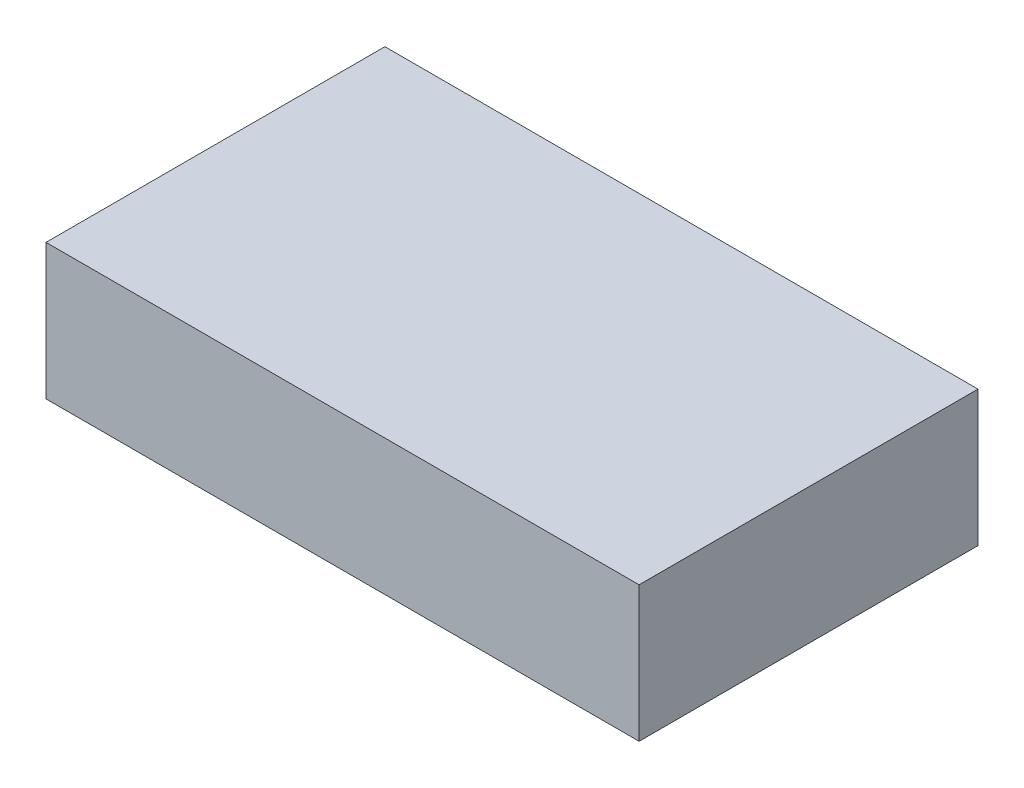
ISO-10303-21;
HEADER;
FILE_DESCRIPTION(('STEP AP214'),'2;1');
FILE_NAME('part.step','',(''),(''),'','','');
FILE_SCHEMA(('AUTOMOTIVE_DESIGN { 1 0 10303 214 1 1 1 1 }'));
ENDSEC;
DATA;
#1=APPLICATION_CONTEXT('core data for automotive mechanical design processes');
#2=APPLICATION_PROTOCOL_DEFINITION('international standard','automotive_design',2000,#1);
#3=PRODUCT_CONTEXT('',#1,'mechanical');
#4=PRODUCT('Part','Part','',(#3));
#5=PRODUCT_RELATED_PRODUCT_CATEGORY('part','',(#4));
#6=PRODUCT_DEFINITION_FORMATION('','',#4);
#7=PRODUCT_DEFINITION_CONTEXT('part definition',#1,'design');
#8=PRODUCT_DEFINITION('design','',#6,#7);
#9=PRODUCT_DEFINITION_SHAPE('','',#8);
#10=(LENGTH_UNIT() NAMED_UNIT(*) SI_UNIT(.MILLI.,.METRE.));
#11=(NAMED_UNIT(*) PLANE_ANGLE_UNIT() SI_UNIT($,.RADIAN.));
#12=(NAMED_UNIT(*) SI_UNIT($,.STERADIAN.) SOLID_ANGLE_UNIT());
#13=UNCERTAINTY_MEASURE_WITH_UNIT(LENGTH_MEASURE(1.E-05),#10,'distance_accuracy_value','');
#14=(GEOMETRIC_REPRESENTATION_CONTEXT(3) GLOBAL_UNCERTAINTY_ASSIGNED_CONTEXT((#13)) GLOBAL_UNIT_ASSIGNED_CONTEXT((#10,
#11,#12)) REPRESENTATION_CONTEXT('',''));
#15=CARTESIAN_POINT('',(0.,0.,0.));
#16=DIRECTION('',(0.,0.,1.));
#17=DIRECTION('',(1.,0.,0.));
#18=AXIS2_PLACEMENT_3D('',#15,#16,#17);
#19=CARTESIAN_POINT('',(17.5,4.,10.));
#20=DIRECTION('',(-1.,0.,0.));
#21=DIRECTION('',(0.,0.,1.));
#22=AXIS2_PLACEMENT_3D('',#19,#20,#21);
#23=PLANE('',#22);
#24=DIRECTION('',(0.,0.,-1.));
#25=VECTOR('',#24,1.);
#26=CARTESIAN_POINT('',(17.5,-4.,10.));
#27=LINE('',#26,#25);
#28=CARTESIAN_POINT('',(17.5,-4.,10.));
#29=VERTEX_POINT('',#28);
#30=CARTESIAN_POINT('',(17.5,-4.,-10.));
#31=VERTEX_POINT('',#30);
#32=EDGE_CURVE('E107',#29,#31,#27,.T.);
#33=ORIENTED_EDGE('',*,*,#32,.T.);
#34=DIRECTION('',(0.,-1.,0.));
#35=VECTOR('',#34,1.);
#36=CARTESIAN_POINT('',(17.5,4.,-10.));
#37=LINE('',#36,#35);
#38=CARTESIAN_POINT('',(17.5,4.,-10.));
#39=VERTEX_POINT('',#38);
#40=EDGE_CURVE('E11',#39,#31,#37,.T.);
#41=ORIENTED_EDGE('',*,*,#40,.F.);
#42=DIRECTION('',(0.,0.,-1.));
#43=VECTOR('',#42,1.);
#44=CARTESIAN_POINT('',(17.5,4.,10.));
#45=LINE('',#44,#43);
#46=CARTESIAN_POINT('',(17.5,4.,10.));
#47=VERTEX_POINT('',#46);
#48=EDGE_CURVE('E91',#47,#39,#45,.T.);
#49=ORIENTED_EDGE('',*,*,#48,.F.);
#50=DIRECTION('',(0.,-1.,0.));
#51=VECTOR('',#50,1.);
#52=CARTESIAN_POINT('',(17.5,4.,10.));
#53=LINE('',#52,#51);
#54=EDGE_CURVE('E103',#47,#29,#53,.T.);
#55=ORIENTED_EDGE('',*,*,#54,.T.);
#56=EDGE_LOOP('',(#33,#41,#49,#55));
#57=FACE_BOUND('',#56,.T.);
#58=ADVANCED_FACE('F39',(#57),#23,.F.);
#59=CARTESIAN_POINT('',(-17.5,4.,-10.));
#60=DIRECTION('',(0.,0.,1.));
#61=DIRECTION('',(1.,0.,0.));
#62=AXIS2_PLACEMENT_3D('',#59,#60,#61);
#63=PLANE('',#62);
#64=DIRECTION('',(-1.,0.,0.));
#65=VECTOR('',#64,1.);
#66=CARTESIAN_POINT('',(-17.5,-4.,-10.));
#67=LINE('',#66,#65);
#68=CARTESIAN_POINT('',(-17.5,-4.,-10.));
#69=VERTEX_POINT('',#68);
#70=EDGE_CURVE('E96',#31,#69,#67,.T.);
#71=ORIENTED_EDGE('',*,*,#70,.T.);
#72=DIRECTION('',(0.,-1.,0.));
#73=VECTOR('',#72,1.);
#74=CARTESIAN_POINT('',(-17.5,4.,-10.));
#75=LINE('',#74,#73);
#76=CARTESIAN_POINT('',(-17.5,4.,-10.));
#77=VERTEX_POINT('',#76);
#78=EDGE_CURVE('E48',#77,#69,#75,.T.);
#79=ORIENTED_EDGE('',*,*,#78,.F.);
#80=DIRECTION('',(-1.,0.,0.));
#81=VECTOR('',#80,1.);
#82=CARTESIAN_POINT('',(-17.5,4.,-10.));
#83=LINE('',#82,#81);
#84=EDGE_CURVE('E86',#39,#77,#83,.T.);
#85=ORIENTED_EDGE('',*,*,#84,.F.);
#86=ORIENTED_EDGE('',*,*,#40,.T.);
#87=EDGE_LOOP('',(#71,#79,#85,#86));
#88=FACE_BOUND('',#87,.T.);
#89=ADVANCED_FACE('F95',(#88),#63,.F.);
#90=CARTESIAN_POINT('',(-17.5,4.,10.));
#91=DIRECTION('',(1.,0.,0.));
#92=DIRECTION('',(0.,0.,-1.));
#93=AXIS2_PLACEMENT_3D('',#90,#91,#92);
#94=PLANE('',#93);
#95=DIRECTION('',(0.,0.,1.));
#96=VECTOR('',#95,1.);
#97=CARTESIAN_POINT('',(-17.5,-4.,10.));
#98=LINE('',#97,#96);
#99=CARTESIAN_POINT('',(-17.5,-4.,10.));
#100=VERTEX_POINT('',#99);
#101=EDGE_CURVE('E73',#69,#100,#98,.T.);
#102=ORIENTED_EDGE('',*,*,#101,.T.);
#103=DIRECTION('',(0.,-1.,0.));
#104=VECTOR('',#103,1.);
#105=CARTESIAN_POINT('',(-17.5,4.,10.));
#106=LINE('',#105,#104);
#107=CARTESIAN_POINT('',(-17.5,4.,10.));
#108=VERTEX_POINT('',#107);
#109=EDGE_CURVE('E98',#108,#100,#106,.T.);
#110=ORIENTED_EDGE('',*,*,#109,.F.);
#111=DIRECTION('',(0.,0.,1.));
#112=VECTOR('',#111,1.);
#113=CARTESIAN_POINT('',(-17.5,4.,10.));
#114=LINE('',#113,#112);
#115=EDGE_CURVE('E89',#77,#108,#114,.T.);
#116=ORIENTED_EDGE('',*,*,#115,.F.);
#117=ORIENTED_EDGE('',*,*,#78,.T.);
#118=EDGE_LOOP('',(#102,#110,#116,#117));
#119=FACE_BOUND('',#118,.T.);
#120=ADVANCED_FACE('F99',(#119),#94,.F.);
#121=CARTESIAN_POINT('',(-17.5,4.,10.));
#122=DIRECTION('',(0.,0.,-1.));
#123=DIRECTION('',(-1.,0.,0.));
#124=AXIS2_PLACEMENT_3D('',#121,#122,#123);
#125=PLANE('',#124);
#126=DIRECTION('',(1.,0.,0.));
#127=VECTOR('',#126,1.);
#128=CARTESIAN_POINT('',(-17.5,-4.,10.));
#129=LINE('',#128,#127);
#130=EDGE_CURVE('E79',#100,#29,#129,.T.);
#131=ORIENTED_EDGE('',*,*,#130,.T.);
#132=ORIENTED_EDGE('',*,*,#54,.F.);
#133=DIRECTION('',(1.,0.,0.));
#134=VECTOR('',#133,1.);
#135=CARTESIAN_POINT('',(-17.5,4.,10.));
#136=LINE('',#135,#134);
#137=EDGE_CURVE('E56',#108,#47,#136,.T.);
#138=ORIENTED_EDGE('',*,*,#137,.F.);
#139=ORIENTED_EDGE('',*,*,#109,.T.);
#140=EDGE_LOOP('',(#131,#132,#138,#139));
#141=FACE_BOUND('',#140,.T.);
#142=ADVANCED_FACE('F120',(#141),#125,.F.);
#143=CARTESIAN_POINT('',(0.,4.,0.));
#144=DIRECTION('',(0.,-1.,0.));
#145=DIRECTION('',(0.,0.,-1.));
#146=AXIS2_PLACEMENT_3D('',#143,#144,#145);
#147=PLANE('',#146);
#148=ORIENTED_EDGE('',*,*,#48,.T.);
#149=ORIENTED_EDGE('',*,*,#84,.T.);
#150=ORIENTED_EDGE('',*,*,#115,.T.);
#151=ORIENTED_EDGE('',*,*,#137,.T.);
#152=EDGE_LOOP('',(#148,#149,#150,#151));
#153=FACE_BOUND('',#152,.T.);
#154=ADVANCED_FACE('F87',(#153),#147,.F.);
#155=CARTESIAN_POINT('',(0.,-4.,0.));
#156=DIRECTION('',(0.,-1.,0.));
#157=DIRECTION('',(0.,0.,-1.));
#158=AXIS2_PLACEMENT_3D('',#155,#156,#157);
#159=PLANE('',#158);
#160=ORIENTED_EDGE('',*,*,#32,.F.);
#161=ORIENTED_EDGE('',*,*,#130,.F.);
#162=ORIENTED_EDGE('',*,*,#101,.F.);
#163=ORIENTED_EDGE('',*,*,#70,.F.);
#164=EDGE_LOOP('',(#160,#161,#162,#163));
#165=FACE_BOUND('',#164,.T.);
#166=ADVANCED_FACE('F123',(#165),#159,.T.);
#167=CLOSED_SHELL('',(#58,#89,#120,#142,#154,#166));
#168=MANIFOLD_SOLID_BREP('B2',#167);
#169=ADVANCED_BREP_SHAPE_REPRESENTATION('',(#18,#168),#14);
#170=SHAPE_DEFINITION_REPRESENTATION(#9,#169);
ENDSEC;
END-ISO-10303-21;
